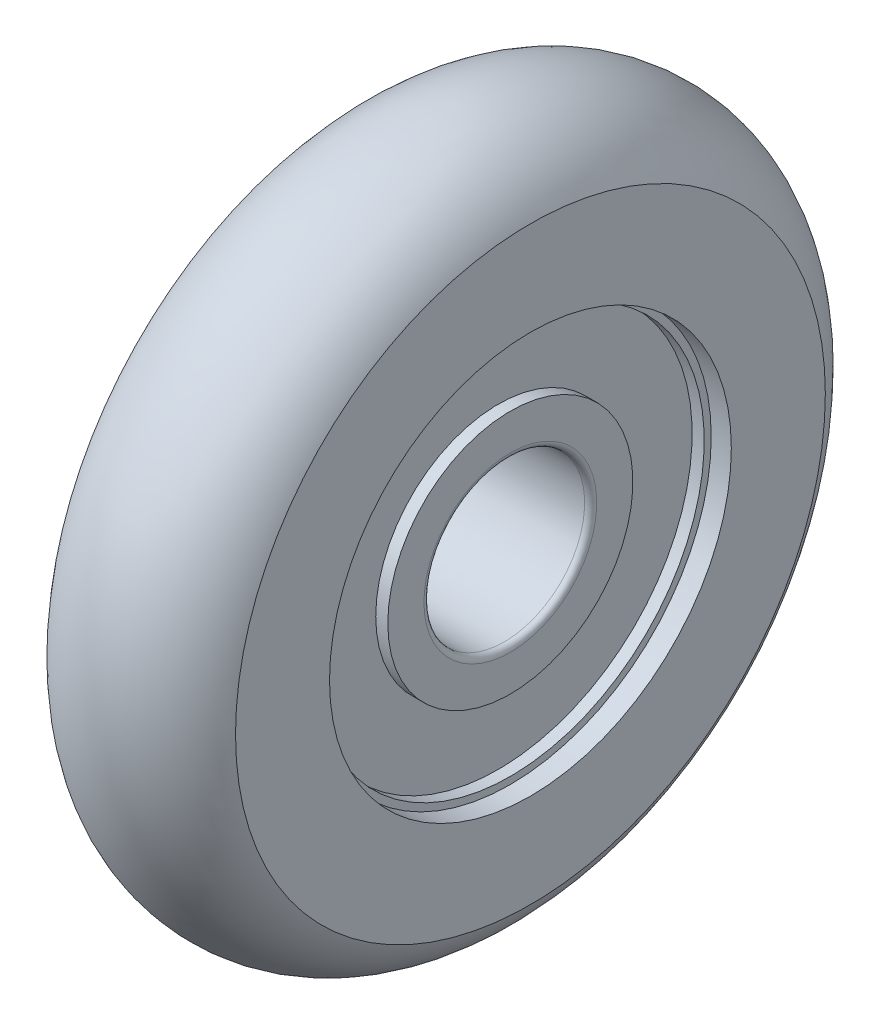
ISO-10303-21;
HEADER;
FILE_DESCRIPTION(('STEP AP214'),'2;1');
FILE_NAME('part.step','',(''),(''),'','','');
FILE_SCHEMA(('AUTOMOTIVE_DESIGN { 1 0 10303 214 1 1 1 1 }'));
ENDSEC;
DATA;
#1=APPLICATION_CONTEXT('core data for automotive mechanical design processes');
#2=APPLICATION_PROTOCOL_DEFINITION('international standard','automotive_design',2000,#1);
#3=PRODUCT_CONTEXT('',#1,'mechanical');
#4=PRODUCT('Part','Part','',(#3));
#5=PRODUCT_RELATED_PRODUCT_CATEGORY('part','',(#4));
#6=PRODUCT_DEFINITION_FORMATION('','',#4);
#7=PRODUCT_DEFINITION_CONTEXT('part definition',#1,'design');
#8=PRODUCT_DEFINITION('design','',#6,#7);
#9=PRODUCT_DEFINITION_SHAPE('','',#8);
#10=(LENGTH_UNIT() NAMED_UNIT(*) SI_UNIT(.MILLI.,.METRE.));
#11=(NAMED_UNIT(*) PLANE_ANGLE_UNIT() SI_UNIT($,.RADIAN.));
#12=(NAMED_UNIT(*) SI_UNIT($,.STERADIAN.) SOLID_ANGLE_UNIT());
#13=UNCERTAINTY_MEASURE_WITH_UNIT(LENGTH_MEASURE(1.E-05),#10,'distance_accuracy_value','');
#14=(GEOMETRIC_REPRESENTATION_CONTEXT(3) GLOBAL_UNCERTAINTY_ASSIGNED_CONTEXT((#13)) GLOBAL_UNIT_ASSIGNED_CONTEXT((#10,
#11,#12)) REPRESENTATION_CONTEXT('',''));
#15=CARTESIAN_POINT('',(0.,0.,0.));
#16=DIRECTION('',(0.,0.,1.));
#17=DIRECTION('',(1.,0.,0.));
#18=AXIS2_PLACEMENT_3D('',#15,#16,#17);
#19=CARTESIAN_POINT('',(-7.,11.,0.));
#20=DIRECTION('',(1.,0.,0.));
#21=DIRECTION('',(0.,0.,-1.));
#22=AXIS2_PLACEMENT_3D('',#19,#20,#21);
#23=PLANE('',#22);
#24=CARTESIAN_POINT('',(-7.,0.,0.));
#25=DIRECTION('',(1.,0.,0.));
#26=DIRECTION('',(0.,0.,-1.));
#27=AXIS2_PLACEMENT_3D('',#24,#25,#26);
#28=CIRCLE('',#27,10.7);
#29=CARTESIAN_POINT('',(-7.,0.,-10.7));
#30=VERTEX_POINT('',#29);
#31=EDGE_CURVE('P0_E40',#30,#30,#28,.F.);
#32=ORIENTED_EDGE('',*,*,#31,.T.);
#33=EDGE_LOOP('',(#32));
#34=FACE_BOUND('',#33,.T.);
#35=CARTESIAN_POINT('',(-7.,0.,0.));
#36=DIRECTION('',(-1.,0.,0.));
#37=DIRECTION('',(0.,0.,1.));
#38=AXIS2_PLACEMENT_3D('',#35,#36,#37);
#39=CIRCLE('',#38,9.65);
#40=CARTESIAN_POINT('',(-7.,0.,9.65));
#41=VERTEX_POINT('',#40);
#42=EDGE_CURVE('P0_E56',#41,#41,#39,.T.);
#43=ORIENTED_EDGE('',*,*,#42,.F.);
#44=EDGE_LOOP('',(#43));
#45=FACE_BOUND('',#44,.T.);
#46=ADVANCED_FACE('P0_F15',(#34,#45),#23,.F.);
#47=CARTESIAN_POINT('',(-7.,0.,0.));
#48=DIRECTION('',(-1.,0.,0.));
#49=DIRECTION('',(0.,0.,1.));
#50=AXIS2_PLACEMENT_3D('',#47,#48,#49);
#51=CYLINDRICAL_SURFACE('',#50,9.65);
#52=CARTESIAN_POINT('',(-6.4,0.,0.));
#53=DIRECTION('',(-1.,0.,0.));
#54=DIRECTION('',(0.,0.,1.));
#55=AXIS2_PLACEMENT_3D('',#52,#53,#54);
#56=CIRCLE('',#55,9.65);
#57=CARTESIAN_POINT('',(-6.4,0.,9.65));
#58=VERTEX_POINT('',#57);
#59=EDGE_CURVE('P0_E60',#58,#58,#56,.T.);
#60=ORIENTED_EDGE('',*,*,#59,.F.);
#61=EDGE_LOOP('',(#60));
#62=FACE_BOUND('',#61,.T.);
#63=ORIENTED_EDGE('',*,*,#42,.T.);
#64=EDGE_LOOP('',(#63));
#65=FACE_BOUND('',#64,.T.);
#66=ADVANCED_FACE('P0_F122',(#62,#65),#51,.F.);
#67=CARTESIAN_POINT('',(-6.4,9.65,0.));
#68=DIRECTION('',(1.,0.,0.));
#69=DIRECTION('',(0.,0.,-1.));
#70=AXIS2_PLACEMENT_3D('',#67,#68,#69);
#71=PLANE('',#70);
#72=CARTESIAN_POINT('',(-6.4,0.,0.));
#73=DIRECTION('',(-1.,0.,0.));
#74=DIRECTION('',(0.,0.,1.));
#75=AXIS2_PLACEMENT_3D('',#72,#73,#74);
#76=CIRCLE('',#75,6.1);
#77=CARTESIAN_POINT('',(-6.4,0.,6.1));
#78=VERTEX_POINT('',#77);
#79=EDGE_CURVE('P0_E64',#78,#78,#76,.T.);
#80=ORIENTED_EDGE('',*,*,#79,.F.);
#81=EDGE_LOOP('',(#80));
#82=FACE_BOUND('',#81,.T.);
#83=ORIENTED_EDGE('',*,*,#59,.T.);
#84=EDGE_LOOP('',(#83));
#85=FACE_BOUND('',#84,.T.);
#86=ADVANCED_FACE('P0_F129',(#82,#85),#71,.F.);
#87=CARTESIAN_POINT('',(-7.,0.,0.));
#88=DIRECTION('',(-1.,0.,0.));
#89=DIRECTION('',(0.,0.,1.));
#90=AXIS2_PLACEMENT_3D('',#87,#88,#89);
#91=CYLINDRICAL_SURFACE('',#90,6.1);
#92=CARTESIAN_POINT('',(-7.,0.,0.));
#93=DIRECTION('',(-1.,0.,0.));
#94=DIRECTION('',(0.,0.,1.));
#95=AXIS2_PLACEMENT_3D('',#92,#93,#94);
#96=CIRCLE('',#95,6.1);
#97=CARTESIAN_POINT('',(-7.,0.,6.1));
#98=VERTEX_POINT('',#97);
#99=EDGE_CURVE('P0_E68',#98,#98,#96,.T.);
#100=ORIENTED_EDGE('',*,*,#99,.F.);
#101=EDGE_LOOP('',(#100));
#102=FACE_BOUND('',#101,.T.);
#103=ORIENTED_EDGE('',*,*,#79,.T.);
#104=EDGE_LOOP('',(#103));
#105=FACE_BOUND('',#104,.T.);
#106=ADVANCED_FACE('P0_F247',(#102,#105),#91,.T.);
#107=CARTESIAN_POINT('',(-7.,6.1,0.));
#108=DIRECTION('',(1.,0.,0.));
#109=DIRECTION('',(0.,0.,-1.));
#110=AXIS2_PLACEMENT_3D('',#107,#108,#109);
#111=PLANE('',#110);
#112=CARTESIAN_POINT('',(-7.,0.,0.));
#113=DIRECTION('',(1.,0.,0.));
#114=DIRECTION('',(0.,0.,-1.));
#115=AXIS2_PLACEMENT_3D('',#112,#113,#114);
#116=CIRCLE('',#115,4.3);
#117=CARTESIAN_POINT('',(-7.,0.,-4.3));
#118=VERTEX_POINT('',#117);
#119=EDGE_CURVE('P0_E10',#118,#118,#116,.T.);
#120=ORIENTED_EDGE('',*,*,#119,.T.);
#121=EDGE_LOOP('',(#120));
#122=FACE_BOUND('',#121,.T.);
#123=ORIENTED_EDGE('',*,*,#99,.T.);
#124=EDGE_LOOP('',(#123));
#125=FACE_BOUND('',#124,.T.);
#126=ADVANCED_FACE('P0_F119',(#122,#125),#111,.F.);
#127=CARTESIAN_POINT('',(-7.,0.,0.));
#128=DIRECTION('',(-1.,0.,0.));
#129=DIRECTION('',(0.,0.,1.));
#130=AXIS2_PLACEMENT_3D('',#127,#128,#129);
#131=CYLINDRICAL_SURFACE('',#130,4.);
#132=CARTESIAN_POINT('',(-0.3,0.,0.));
#133=DIRECTION('',(-1.,0.,0.));
#134=DIRECTION('',(0.,0.,1.));
#135=AXIS2_PLACEMENT_3D('',#132,#133,#134);
#136=CIRCLE('',#135,4.);
#137=CARTESIAN_POINT('',(-0.3,0.,4.));
#138=VERTEX_POINT('',#137);
#139=EDGE_CURVE('P0_E23',#138,#138,#136,.F.);
#140=ORIENTED_EDGE('',*,*,#139,.T.);
#141=EDGE_LOOP('',(#140));
#142=FACE_BOUND('',#141,.T.);
#143=CARTESIAN_POINT('',(-6.7,0.,0.));
#144=DIRECTION('',(1.,0.,0.));
#145=DIRECTION('',(0.,0.,-1.));
#146=AXIS2_PLACEMENT_3D('',#143,#144,#145);
#147=CIRCLE('',#146,4.);
#148=CARTESIAN_POINT('',(-6.7,0.,-4.));
#149=VERTEX_POINT('',#148);
#150=EDGE_CURVE('P0_E29',#149,#149,#147,.F.);
#151=ORIENTED_EDGE('',*,*,#150,.T.);
#152=EDGE_LOOP('',(#151));
#153=FACE_BOUND('',#152,.T.);
#154=ADVANCED_FACE('P0_F111',(#142,#153),#131,.F.);
#155=CARTESIAN_POINT('',(0.,6.1,0.));
#156=DIRECTION('',(-1.,0.,0.));
#157=DIRECTION('',(0.,0.,1.));
#158=AXIS2_PLACEMENT_3D('',#155,#156,#157);
#159=PLANE('',#158);
#160=CARTESIAN_POINT('',(0.,0.,0.));
#161=DIRECTION('',(-1.,0.,0.));
#162=DIRECTION('',(0.,0.,1.));
#163=AXIS2_PLACEMENT_3D('',#160,#161,#162);
#164=CIRCLE('',#163,4.3);
#165=CARTESIAN_POINT('',(0.,0.,4.3));
#166=VERTEX_POINT('',#165);
#167=EDGE_CURVE('P0_E34',#166,#166,#164,.T.);
#168=ORIENTED_EDGE('',*,*,#167,.T.);
#169=EDGE_LOOP('',(#168));
#170=FACE_BOUND('',#169,.T.);
#171=CARTESIAN_POINT('',(0.,0.,0.));
#172=DIRECTION('',(-1.,0.,0.));
#173=DIRECTION('',(0.,0.,1.));
#174=AXIS2_PLACEMENT_3D('',#171,#172,#173);
#175=CIRCLE('',#174,6.1);
#176=CARTESIAN_POINT('',(0.,0.,6.1));
#177=VERTEX_POINT('',#176);
#178=EDGE_CURVE('P0_E72',#177,#177,#175,.T.);
#179=ORIENTED_EDGE('',*,*,#178,.F.);
#180=EDGE_LOOP('',(#179));
#181=FACE_BOUND('',#180,.T.);
#182=ADVANCED_FACE('P0_F106',(#170,#181),#159,.F.);
#183=CARTESIAN_POINT('',(-7.,0.,0.));
#184=DIRECTION('',(-1.,0.,0.));
#185=DIRECTION('',(0.,0.,1.));
#186=AXIS2_PLACEMENT_3D('',#183,#184,#185);
#187=CYLINDRICAL_SURFACE('',#186,6.1);
#188=CARTESIAN_POINT('',(-0.600000000000001,0.,0.));
#189=DIRECTION('',(-1.,0.,0.));
#190=DIRECTION('',(0.,0.,1.));
#191=AXIS2_PLACEMENT_3D('',#188,#189,#190);
#192=CIRCLE('',#191,6.1);
#193=CARTESIAN_POINT('',(-0.600000000000001,0.,6.1));
#194=VERTEX_POINT('',#193);
#195=EDGE_CURVE('P0_E76',#194,#194,#192,.T.);
#196=ORIENTED_EDGE('',*,*,#195,.F.);
#197=EDGE_LOOP('',(#196));
#198=FACE_BOUND('',#197,.T.);
#199=ORIENTED_EDGE('',*,*,#178,.T.);
#200=EDGE_LOOP('',(#199));
#201=FACE_BOUND('',#200,.T.);
#202=ADVANCED_FACE('P0_F100',(#198,#201),#187,.T.);
#203=CARTESIAN_POINT('',(-0.600000000000001,9.65,0.));
#204=DIRECTION('',(-1.,0.,0.));
#205=DIRECTION('',(0.,0.,1.));
#206=AXIS2_PLACEMENT_3D('',#203,#204,#205);
#207=PLANE('',#206);
#208=CARTESIAN_POINT('',(-0.600000000000001,0.,0.));
#209=DIRECTION('',(-1.,0.,0.));
#210=DIRECTION('',(0.,0.,1.));
#211=AXIS2_PLACEMENT_3D('',#208,#209,#210);
#212=CIRCLE('',#211,9.65);
#213=CARTESIAN_POINT('',(-0.600000000000001,0.,9.65));
#214=VERTEX_POINT('',#213);
#215=EDGE_CURVE('P0_E80',#214,#214,#212,.T.);
#216=ORIENTED_EDGE('',*,*,#215,.F.);
#217=EDGE_LOOP('',(#216));
#218=FACE_BOUND('',#217,.T.);
#219=ORIENTED_EDGE('',*,*,#195,.T.);
#220=EDGE_LOOP('',(#219));
#221=FACE_BOUND('',#220,.T.);
#222=ADVANCED_FACE('P0_F94',(#218,#221),#207,.F.);
#223=CARTESIAN_POINT('',(-7.,0.,0.));
#224=DIRECTION('',(-1.,0.,0.));
#225=DIRECTION('',(0.,0.,1.));
#226=AXIS2_PLACEMENT_3D('',#223,#224,#225);
#227=CYLINDRICAL_SURFACE('',#226,9.65);
#228=CARTESIAN_POINT('',(0.,0.,0.));
#229=DIRECTION('',(-1.,0.,0.));
#230=DIRECTION('',(0.,0.,1.));
#231=AXIS2_PLACEMENT_3D('',#228,#229,#230);
#232=CIRCLE('',#231,9.65);
#233=CARTESIAN_POINT('',(0.,0.,9.65));
#234=VERTEX_POINT('',#233);
#235=EDGE_CURVE('P0_E84',#234,#234,#232,.T.);
#236=ORIENTED_EDGE('',*,*,#235,.F.);
#237=EDGE_LOOP('',(#236));
#238=FACE_BOUND('',#237,.T.);
#239=ORIENTED_EDGE('',*,*,#215,.T.);
#240=EDGE_LOOP('',(#239));
#241=FACE_BOUND('',#240,.T.);
#242=ADVANCED_FACE('P0_F91',(#238,#241),#227,.F.);
#243=CARTESIAN_POINT('',(0.,11.,0.));
#244=DIRECTION('',(-1.,0.,0.));
#245=DIRECTION('',(0.,0.,1.));
#246=AXIS2_PLACEMENT_3D('',#243,#244,#245);
#247=PLANE('',#246);
#248=CARTESIAN_POINT('',(0.,0.,0.));
#249=DIRECTION('',(-1.,0.,0.));
#250=DIRECTION('',(0.,0.,1.));
#251=AXIS2_PLACEMENT_3D('',#248,#249,#250);
#252=CIRCLE('',#251,10.7);
#253=CARTESIAN_POINT('',(0.,0.,10.7));
#254=VERTEX_POINT('',#253);
#255=EDGE_CURVE('P0_E44',#254,#254,#252,.F.);
#256=ORIENTED_EDGE('',*,*,#255,.T.);
#257=EDGE_LOOP('',(#256));
#258=FACE_BOUND('',#257,.T.);
#259=ORIENTED_EDGE('',*,*,#235,.T.);
#260=EDGE_LOOP('',(#259));
#261=FACE_BOUND('',#260,.T.);
#262=ADVANCED_FACE('P0_F89',(#258,#261),#247,.F.);
#263=CARTESIAN_POINT('',(-7.,0.,0.));
#264=DIRECTION('',(-1.,0.,0.));
#265=DIRECTION('',(0.,0.,1.));
#266=AXIS2_PLACEMENT_3D('',#263,#264,#265);
#267=CYLINDRICAL_SURFACE('',#266,11.);
#268=CARTESIAN_POINT('',(-0.3,0.,0.));
#269=DIRECTION('',(-1.,0.,0.));
#270=DIRECTION('',(0.,0.,1.));
#271=AXIS2_PLACEMENT_3D('',#268,#269,#270);
#272=CIRCLE('',#271,11.);
#273=CARTESIAN_POINT('',(-0.3,0.,11.));
#274=VERTEX_POINT('',#273);
#275=EDGE_CURVE('P0_E48',#274,#274,#272,.T.);
#276=ORIENTED_EDGE('',*,*,#275,.T.);
#277=EDGE_LOOP('',(#276));
#278=FACE_BOUND('',#277,.T.);
#279=CARTESIAN_POINT('',(-6.7,0.,0.));
#280=DIRECTION('',(1.,0.,0.));
#281=DIRECTION('',(0.,0.,-1.));
#282=AXIS2_PLACEMENT_3D('',#279,#280,#281);
#283=CIRCLE('',#282,11.);
#284=CARTESIAN_POINT('',(-6.7,0.,-11.));
#285=VERTEX_POINT('',#284);
#286=EDGE_CURVE('P0_E52',#285,#285,#283,.T.);
#287=ORIENTED_EDGE('',*,*,#286,.T.);
#288=EDGE_LOOP('',(#287));
#289=FACE_BOUND('',#288,.T.);
#290=ADVANCED_FACE('P0_F139',(#278,#289),#267,.T.);
#291=CARTESIAN_POINT('',(-0.3,0.,0.));
#292=DIRECTION('',(-1.,0.,0.));
#293=DIRECTION('',(0.,0.,1.));
#294=AXIS2_PLACEMENT_3D('',#291,#292,#293);
#295=TOROIDAL_SURFACE('',#294,10.7,0.3);
#296=ORIENTED_EDGE('',*,*,#255,.F.);
#297=EDGE_LOOP('',(#296));
#298=FACE_BOUND('',#297,.T.);
#299=ORIENTED_EDGE('',*,*,#275,.F.);
#300=EDGE_LOOP('',(#299));
#301=FACE_BOUND('',#300,.T.);
#302=ADVANCED_FACE('P0_F135',(#298,#301),#295,.T.);
#303=CARTESIAN_POINT('',(-6.7,0.,0.));
#304=DIRECTION('',(1.,0.,0.));
#305=DIRECTION('',(0.,0.,-1.));
#306=AXIS2_PLACEMENT_3D('',#303,#304,#305);
#307=TOROIDAL_SURFACE('',#306,10.7,0.3);
#308=ORIENTED_EDGE('',*,*,#286,.F.);
#309=EDGE_LOOP('',(#308));
#310=FACE_BOUND('',#309,.T.);
#311=ORIENTED_EDGE('',*,*,#31,.F.);
#312=EDGE_LOOP('',(#311));
#313=FACE_BOUND('',#312,.T.);
#314=ADVANCED_FACE('P0_F138',(#310,#313),#307,.T.);
#315=CARTESIAN_POINT('',(-0.3,0.,0.));
#316=DIRECTION('',(-1.,0.,0.));
#317=DIRECTION('',(0.,0.,1.));
#318=AXIS2_PLACEMENT_3D('',#315,#316,#317);
#319=TOROIDAL_SURFACE('',#318,4.3,0.3);
#320=ORIENTED_EDGE('',*,*,#139,.F.);
#321=EDGE_LOOP('',(#320));
#322=FACE_BOUND('',#321,.T.);
#323=ORIENTED_EDGE('',*,*,#167,.F.);
#324=EDGE_LOOP('',(#323));
#325=FACE_BOUND('',#324,.T.);
#326=ADVANCED_FACE('P0_F142',(#322,#325),#319,.T.);
#327=CARTESIAN_POINT('',(-6.7,0.,0.));
#328=DIRECTION('',(1.,0.,0.));
#329=DIRECTION('',(0.,0.,-1.));
#330=AXIS2_PLACEMENT_3D('',#327,#328,#329);
#331=TOROIDAL_SURFACE('',#330,4.3,0.3);
#332=ORIENTED_EDGE('',*,*,#119,.F.);
#333=EDGE_LOOP('',(#332));
#334=FACE_BOUND('',#333,.T.);
#335=ORIENTED_EDGE('',*,*,#150,.F.);
#336=EDGE_LOOP('',(#335));
#337=FACE_BOUND('',#336,.T.);
#338=ADVANCED_FACE('P0_F17',(#334,#337),#331,.T.);
#339=CLOSED_SHELL('',(#46,#66,#86,#106,#126,#154,#182,#202,#222,#242,#262,#290,#302,#314,#326,#338));
#340=MANIFOLD_SOLID_BREP('P0_B1',#339);
#341=CARTESIAN_POINT('',(-7.,11.,0.));
#342=DIRECTION('',(-1.,0.,0.));
#343=DIRECTION('',(0.,0.,1.));
#344=AXIS2_PLACEMENT_3D('',#341,#342,#343);
#345=PLANE('',#344);
#346=CARTESIAN_POINT('',(-7.,0.,0.));
#347=DIRECTION('',(-1.,0.,0.));
#348=DIRECTION('',(0.,0.,1.));
#349=AXIS2_PLACEMENT_3D('',#346,#347,#348);
#350=CIRCLE('',#349,11.);
#351=CARTESIAN_POINT('',(-7.,0.,11.));
#352=VERTEX_POINT('',#351);
#353=EDGE_CURVE('P1_E10',#352,#352,#350,.T.);
#354=ORIENTED_EDGE('',*,*,#353,.F.);
#355=EDGE_LOOP('',(#354));
#356=FACE_BOUND('',#355,.T.);
#357=CARTESIAN_POINT('',(-7.,0.,0.));
#358=DIRECTION('',(-1.,0.,0.));
#359=DIRECTION('',(0.,0.,1.));
#360=AXIS2_PLACEMENT_3D('',#357,#358,#359);
#361=CIRCLE('',#360,10.);
#362=CARTESIAN_POINT('',(-7.,0.,10.));
#363=VERTEX_POINT('',#362);
#364=EDGE_CURVE('P1_E43',#363,#363,#361,.T.);
#365=ORIENTED_EDGE('',*,*,#364,.T.);
#366=EDGE_LOOP('',(#365));
#367=FACE_BOUND('',#366,.T.);
#368=ADVANCED_FACE('P1_F15',(#356,#367),#345,.F.);
#369=CARTESIAN_POINT('',(-8.,0.,0.));
#370=DIRECTION('',(-1.,0.,0.));
#371=DIRECTION('',(0.,0.,1.));
#372=AXIS2_PLACEMENT_3D('',#369,#370,#371);
#373=CYLINDRICAL_SURFACE('',#372,11.);
#374=CARTESIAN_POINT('',(0.,0.,0.));
#375=DIRECTION('',(-1.,0.,0.));
#376=DIRECTION('',(0.,0.,1.));
#377=AXIS2_PLACEMENT_3D('',#374,#375,#376);
#378=CIRCLE('',#377,11.);
#379=CARTESIAN_POINT('',(0.,0.,11.));
#380=VERTEX_POINT('',#379);
#381=EDGE_CURVE('P1_E21',#380,#380,#378,.T.);
#382=ORIENTED_EDGE('',*,*,#381,.F.);
#383=EDGE_LOOP('',(#382));
#384=FACE_BOUND('',#383,.T.);
#385=ORIENTED_EDGE('',*,*,#353,.T.);
#386=EDGE_LOOP('',(#385));
#387=FACE_BOUND('',#386,.T.);
#388=ADVANCED_FACE('P1_F80',(#384,#387),#373,.F.);
#389=CARTESIAN_POINT('',(0.,10.,0.));
#390=DIRECTION('',(1.,0.,0.));
#391=DIRECTION('',(0.,0.,-1.));
#392=AXIS2_PLACEMENT_3D('',#389,#390,#391);
#393=PLANE('',#392);
#394=CARTESIAN_POINT('',(0.,0.,0.));
#395=DIRECTION('',(-1.,0.,0.));
#396=DIRECTION('',(0.,0.,1.));
#397=AXIS2_PLACEMENT_3D('',#394,#395,#396);
#398=CIRCLE('',#397,10.);
#399=CARTESIAN_POINT('',(0.,0.,10.));
#400=VERTEX_POINT('',#399);
#401=EDGE_CURVE('P1_E25',#400,#400,#398,.T.);
#402=ORIENTED_EDGE('',*,*,#401,.F.);
#403=EDGE_LOOP('',(#402));
#404=FACE_BOUND('',#403,.T.);
#405=ORIENTED_EDGE('',*,*,#381,.T.);
#406=EDGE_LOOP('',(#405));
#407=FACE_BOUND('',#406,.T.);
#408=ADVANCED_FACE('P1_F75',(#404,#407),#393,.F.);
#409=CARTESIAN_POINT('',(-8.,0.,0.));
#410=DIRECTION('',(-1.,0.,0.));
#411=DIRECTION('',(0.,0.,1.));
#412=AXIS2_PLACEMENT_3D('',#409,#410,#411);
#413=CYLINDRICAL_SURFACE('',#412,10.);
#414=CARTESIAN_POINT('',(0.999999999999999,0.,0.));
#415=DIRECTION('',(-1.,0.,0.));
#416=DIRECTION('',(0.,0.,1.));
#417=AXIS2_PLACEMENT_3D('',#414,#415,#416);
#418=CIRCLE('',#417,10.);
#419=CARTESIAN_POINT('',(0.999999999999999,0.,10.));
#420=VERTEX_POINT('',#419);
#421=EDGE_CURVE('P1_E29',#420,#420,#418,.T.);
#422=ORIENTED_EDGE('',*,*,#421,.F.);
#423=EDGE_LOOP('',(#422));
#424=FACE_BOUND('',#423,.T.);
#425=ORIENTED_EDGE('',*,*,#401,.T.);
#426=EDGE_LOOP('',(#425));
#427=FACE_BOUND('',#426,.T.);
#428=ADVANCED_FACE('P1_F69',(#424,#427),#413,.F.);
#429=CARTESIAN_POINT('',(1.,14.6794494717703,0.));
#430=DIRECTION('',(-1.,0.,0.));
#431=DIRECTION('',(0.,0.,1.));
#432=AXIS2_PLACEMENT_3D('',#429,#430,#431);
#433=PLANE('',#432);
#434=CARTESIAN_POINT('',(1.,0.,0.));
#435=DIRECTION('',(-1.,0.,0.));
#436=DIRECTION('',(0.,0.,1.));
#437=AXIS2_PLACEMENT_3D('',#434,#435,#436);
#438=CIRCLE('',#437,14.6794494717703);
#439=CARTESIAN_POINT('',(1.,0.,14.6794494717703));
#440=VERTEX_POINT('',#439);
#441=EDGE_CURVE('P1_E34',#440,#440,#438,.T.);
#442=ORIENTED_EDGE('',*,*,#441,.F.);
#443=EDGE_LOOP('',(#442));
#444=FACE_BOUND('',#443,.T.);
#445=ORIENTED_EDGE('',*,*,#421,.T.);
#446=EDGE_LOOP('',(#445));
#447=FACE_BOUND('',#446,.T.);
#448=ADVANCED_FACE('P1_F63',(#444,#447),#433,.F.);
#449=CARTESIAN_POINT('',(-3.5,0.,0.));
#450=DIRECTION('',(-1.,0.,0.));
#451=DIRECTION('',(0.,0.,1.));
#452=AXIS2_PLACEMENT_3D('',#449,#450,#451);
#453=TOROIDAL_SURFACE('',#452,12.5,5.);
#454=CARTESIAN_POINT('',(-8.,0.,0.));
#455=DIRECTION('',(-1.,0.,0.));
#456=DIRECTION('',(0.,0.,1.));
#457=AXIS2_PLACEMENT_3D('',#454,#455,#456);
#458=CIRCLE('',#457,14.6794494717703);
#459=CARTESIAN_POINT('',(-8.,0.,14.6794494717703));
#460=VERTEX_POINT('',#459);
#461=EDGE_CURVE('P1_E37',#460,#460,#458,.T.);
#462=ORIENTED_EDGE('',*,*,#461,.F.);
#463=EDGE_LOOP('',(#462));
#464=FACE_BOUND('',#463,.T.);
#465=ORIENTED_EDGE('',*,*,#441,.T.);
#466=EDGE_LOOP('',(#465));
#467=FACE_BOUND('',#466,.T.);
#468=ADVANCED_FACE('P1_F57',(#464,#467),#453,.T.);
#469=CARTESIAN_POINT('',(-8.,10.,0.));
#470=DIRECTION('',(1.,0.,0.));
#471=DIRECTION('',(0.,0.,-1.));
#472=AXIS2_PLACEMENT_3D('',#469,#470,#471);
#473=PLANE('',#472);
#474=CARTESIAN_POINT('',(-8.,0.,0.));
#475=DIRECTION('',(-1.,0.,0.));
#476=DIRECTION('',(0.,0.,1.));
#477=AXIS2_PLACEMENT_3D('',#474,#475,#476);
#478=CIRCLE('',#477,10.);
#479=CARTESIAN_POINT('',(-8.,0.,10.));
#480=VERTEX_POINT('',#479);
#481=EDGE_CURVE('P1_E40',#480,#480,#478,.T.);
#482=ORIENTED_EDGE('',*,*,#481,.F.);
#483=EDGE_LOOP('',(#482));
#484=FACE_BOUND('',#483,.T.);
#485=ORIENTED_EDGE('',*,*,#461,.T.);
#486=EDGE_LOOP('',(#485));
#487=FACE_BOUND('',#486,.T.);
#488=ADVANCED_FACE('P1_F51',(#484,#487),#473,.F.);
#489=CARTESIAN_POINT('',(-8.,0.,0.));
#490=DIRECTION('',(-1.,0.,0.));
#491=DIRECTION('',(0.,0.,1.));
#492=AXIS2_PLACEMENT_3D('',#489,#490,#491);
#493=CYLINDRICAL_SURFACE('',#492,10.);
#494=ORIENTED_EDGE('',*,*,#364,.F.);
#495=EDGE_LOOP('',(#494));
#496=FACE_BOUND('',#495,.T.);
#497=ORIENTED_EDGE('',*,*,#481,.T.);
#498=EDGE_LOOP('',(#497));
#499=FACE_BOUND('',#498,.T.);
#500=ADVANCED_FACE('P1_F48',(#496,#499),#493,.F.);
#501=CLOSED_SHELL('',(#368,#388,#408,#428,#448,#468,#488,#500));
#502=MANIFOLD_SOLID_BREP('P1_B1',#501);
#503=ADVANCED_BREP_SHAPE_REPRESENTATION('',(#18,#340,#502),#14);
#504=SHAPE_DEFINITION_REPRESENTATION(#9,#503);
ENDSEC;
END-ISO-10303-21;
